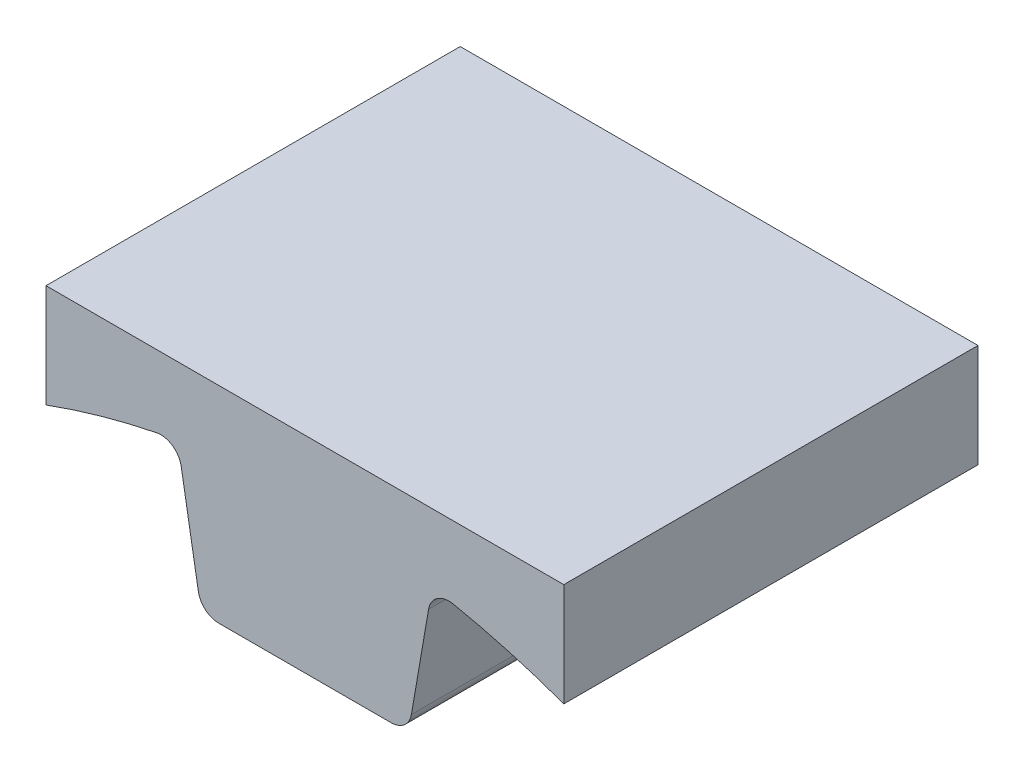
ISO-10303-21;
HEADER;
FILE_DESCRIPTION(('STEP AP214'),'2;1');
FILE_NAME('part.step','',(''),(''),'','','');
FILE_SCHEMA(('AUTOMOTIVE_DESIGN { 1 0 10303 214 1 1 1 1 }'));
ENDSEC;
DATA;
#1=APPLICATION_CONTEXT('core data for automotive mechanical design processes');
#2=APPLICATION_PROTOCOL_DEFINITION('international standard','automotive_design',2000,#1);
#3=PRODUCT_CONTEXT('',#1,'mechanical');
#4=PRODUCT('Part','Part','',(#3));
#5=PRODUCT_RELATED_PRODUCT_CATEGORY('part','',(#4));
#6=PRODUCT_DEFINITION_FORMATION('','',#4);
#7=PRODUCT_DEFINITION_CONTEXT('part definition',#1,'design');
#8=PRODUCT_DEFINITION('design','',#6,#7);
#9=PRODUCT_DEFINITION_SHAPE('','',#8);
#10=(LENGTH_UNIT() NAMED_UNIT(*) SI_UNIT(.MILLI.,.METRE.));
#11=(NAMED_UNIT(*) PLANE_ANGLE_UNIT() SI_UNIT($,.RADIAN.));
#12=(NAMED_UNIT(*) SI_UNIT($,.STERADIAN.) SOLID_ANGLE_UNIT());
#13=UNCERTAINTY_MEASURE_WITH_UNIT(LENGTH_MEASURE(1.E-05),#10,'distance_accuracy_value','');
#14=(GEOMETRIC_REPRESENTATION_CONTEXT(3) GLOBAL_UNCERTAINTY_ASSIGNED_CONTEXT((#13)) GLOBAL_UNIT_ASSIGNED_CONTEXT((#10,
#11,#12)) REPRESENTATION_CONTEXT('',''));
#15=CARTESIAN_POINT('',(0.,0.,0.));
#16=DIRECTION('',(0.,0.,1.));
#17=DIRECTION('',(1.,0.,0.));
#18=AXIS2_PLACEMENT_3D('',#15,#16,#17);
#19=CARTESIAN_POINT('',(12.7,73.8463201567954,50.8));
#20=DIRECTION('',(-0.985531811148546,0.169490557891188,0.));
#21=DIRECTION('',(-0.169490557891188,-0.985531811148546,0.));
#22=AXIS2_PLACEMENT_3D('',#19,#20,#21);
#23=PLANE('',#22);
#24=DIRECTION('',(0.169490557891188,0.985531811148546,0.));
#25=VECTOR('',#24,1.);
#26=CARTESIAN_POINT('',(12.7,73.8463201567954,50.8));
#27=LINE('',#26,#25);
#28=CARTESIAN_POINT('',(13.0627882002334,75.9558141397518,50.8));
#29=VERTEX_POINT('',#28);
#30=CARTESIAN_POINT('',(15.1692294033622,88.2040764608313,50.8));
#31=VERTEX_POINT('',#30);
#32=EDGE_CURVE('E137',#29,#31,#27,.T.);
#33=ORIENTED_EDGE('',*,*,#32,.F.);
#34=DIRECTION('',(0.,0.,-1.));
#35=VECTOR('',#34,1.);
#36=CARTESIAN_POINT('',(13.0627882002334,75.9558141397518,50.8));
#37=LINE('',#36,#35);
#38=CARTESIAN_POINT('',(13.0627882002334,75.9558141397518,0.));
#39=VERTEX_POINT('',#38);
#40=EDGE_CURVE('E240',#29,#39,#37,.T.);
#41=ORIENTED_EDGE('',*,*,#40,.T.);
#42=DIRECTION('',(0.169490557891188,0.985531811148546,0.));
#43=VECTOR('',#42,1.);
#44=CARTESIAN_POINT('',(12.7,73.8463201567954,0.));
#45=LINE('',#44,#43);
#46=CARTESIAN_POINT('',(15.1692294033622,88.2040764608313,0.));
#47=VERTEX_POINT('',#46);
#48=EDGE_CURVE('E175',#39,#47,#45,.T.);
#49=ORIENTED_EDGE('',*,*,#48,.T.);
#50=DIRECTION('',(0.,0.,1.));
#51=VECTOR('',#50,1.);
#52=CARTESIAN_POINT('',(15.1692294033622,88.2040764608313,50.8));
#53=LINE('',#52,#51);
#54=EDGE_CURVE('E61',#47,#31,#53,.T.);
#55=ORIENTED_EDGE('',*,*,#54,.T.);
#56=EDGE_LOOP('',(#33,#41,#49,#55));
#57=FACE_BOUND('',#56,.T.);
#58=ADVANCED_FACE('F39',(#57),#23,.F.);
#59=CARTESIAN_POINT('',(0.,0.,50.8));
#60=DIRECTION('',(0.,0.,-1.));
#61=DIRECTION('',(-1.,0.,0.));
#62=AXIS2_PLACEMENT_3D('',#59,#60,#61);
#63=CYLINDRICAL_SURFACE('',#62,92.075);
#64=CARTESIAN_POINT('',(0.,0.,50.8));
#65=DIRECTION('',(0.,0.,-1.));
#66=DIRECTION('',(1.,0.,0.));
#67=AXIS2_PLACEMENT_3D('',#64,#65,#66);
#68=CIRCLE('',#67,92.075);
#69=CARTESIAN_POINT('',(18.1738271598122,90.2636008109873,50.8));
#70=VERTEX_POINT('',#69);
#71=CARTESIAN_POINT('',(31.75,86.4276756889829,50.8));
#72=VERTEX_POINT('',#71);
#73=EDGE_CURVE('E126',#70,#72,#68,.T.);
#74=ORIENTED_EDGE('',*,*,#73,.F.);
#75=DIRECTION('',(0.,0.,-1.));
#76=VECTOR('',#75,1.);
#77=CARTESIAN_POINT('',(18.1738271598122,90.2636008109873,50.8));
#78=LINE('',#77,#76);
#79=CARTESIAN_POINT('',(18.1738271598122,90.2636008109873,0.));
#80=VERTEX_POINT('',#79);
#81=EDGE_CURVE('E244',#70,#80,#78,.T.);
#82=ORIENTED_EDGE('',*,*,#81,.T.);
#83=CARTESIAN_POINT('',(0.,0.,0.));
#84=DIRECTION('',(0.,0.,-1.));
#85=DIRECTION('',(1.,0.,0.));
#86=AXIS2_PLACEMENT_3D('',#83,#84,#85);
#87=CIRCLE('',#86,92.075);
#88=CARTESIAN_POINT('',(31.75,86.4276756889829,0.));
#89=VERTEX_POINT('',#88);
#90=EDGE_CURVE('E143',#80,#89,#87,.T.);
#91=ORIENTED_EDGE('',*,*,#90,.T.);
#92=DIRECTION('',(0.,0.,-1.));
#93=VECTOR('',#92,1.);
#94=CARTESIAN_POINT('',(31.75,86.4276756889829,50.8));
#95=LINE('',#94,#93);
#96=EDGE_CURVE('E140',#72,#89,#95,.T.);
#97=ORIENTED_EDGE('',*,*,#96,.F.);
#98=EDGE_LOOP('',(#74,#82,#91,#97));
#99=FACE_BOUND('',#98,.T.);
#100=ADVANCED_FACE('F141',(#99),#63,.F.);
#101=CARTESIAN_POINT('',(31.75,99.1022756889829,50.8));
#102=DIRECTION('',(-1.,0.,0.));
#103=DIRECTION('',(0.,-1.,0.));
#104=AXIS2_PLACEMENT_3D('',#101,#102,#103);
#105=PLANE('',#104);
#106=DIRECTION('',(0.,1.,0.));
#107=VECTOR('',#106,1.);
#108=CARTESIAN_POINT('',(31.75,99.1022756889829,0.));
#109=LINE('',#108,#107);
#110=CARTESIAN_POINT('',(31.75,99.1022756889829,0.));
#111=VERTEX_POINT('',#110);
#112=EDGE_CURVE('E180',#89,#111,#109,.T.);
#113=ORIENTED_EDGE('',*,*,#112,.T.);
#114=DIRECTION('',(0.,0.,-1.));
#115=VECTOR('',#114,1.);
#116=CARTESIAN_POINT('',(31.75,99.1022756889829,50.8));
#117=LINE('',#116,#115);
#118=CARTESIAN_POINT('',(31.75,99.1022756889829,50.8));
#119=VERTEX_POINT('',#118);
#120=EDGE_CURVE('E148',#119,#111,#117,.T.);
#121=ORIENTED_EDGE('',*,*,#120,.F.);
#122=DIRECTION('',(0.,1.,0.));
#123=VECTOR('',#122,1.);
#124=CARTESIAN_POINT('',(31.75,99.1022756889829,50.8));
#125=LINE('',#124,#123);
#126=EDGE_CURVE('E131',#72,#119,#125,.T.);
#127=ORIENTED_EDGE('',*,*,#126,.F.);
#128=ORIENTED_EDGE('',*,*,#96,.T.);
#129=EDGE_LOOP('',(#113,#121,#127,#128));
#130=FACE_BOUND('',#129,.T.);
#131=ADVANCED_FACE('F150',(#130),#105,.F.);
#132=CARTESIAN_POINT('',(-31.75,99.1022756889829,50.8));
#133=DIRECTION('',(0.,-1.,0.));
#134=DIRECTION('',(0.,0.,-1.));
#135=AXIS2_PLACEMENT_3D('',#132,#133,#134);
#136=PLANE('',#135);
#137=DIRECTION('',(-1.,0.,0.));
#138=VECTOR('',#137,1.);
#139=CARTESIAN_POINT('',(-31.75,99.1022756889829,0.));
#140=LINE('',#139,#138);
#141=CARTESIAN_POINT('',(-31.75,99.1022756889829,0.));
#142=VERTEX_POINT('',#141);
#143=EDGE_CURVE('E183',#111,#142,#140,.T.);
#144=ORIENTED_EDGE('',*,*,#143,.T.);
#145=DIRECTION('',(0.,0.,-1.));
#146=VECTOR('',#145,1.);
#147=CARTESIAN_POINT('',(-31.75,99.1022756889829,50.8));
#148=LINE('',#147,#146);
#149=CARTESIAN_POINT('',(-31.75,99.1022756889829,50.8));
#150=VERTEX_POINT('',#149);
#151=EDGE_CURVE('E204',#150,#142,#148,.T.);
#152=ORIENTED_EDGE('',*,*,#151,.F.);
#153=DIRECTION('',(-1.,0.,0.));
#154=VECTOR('',#153,1.);
#155=CARTESIAN_POINT('',(-31.75,99.1022756889829,50.8));
#156=LINE('',#155,#154);
#157=EDGE_CURVE('E154',#119,#150,#156,.T.);
#158=ORIENTED_EDGE('',*,*,#157,.F.);
#159=ORIENTED_EDGE('',*,*,#120,.T.);
#160=EDGE_LOOP('',(#144,#152,#158,#159));
#161=FACE_BOUND('',#160,.T.);
#162=ADVANCED_FACE('F310',(#161),#136,.F.);
#163=CARTESIAN_POINT('',(-31.75,99.1022756889829,50.8));
#164=DIRECTION('',(1.,0.,0.));
#165=DIRECTION('',(0.,1.,0.));
#166=AXIS2_PLACEMENT_3D('',#163,#164,#165);
#167=PLANE('',#166);
#168=DIRECTION('',(0.,-1.,0.));
#169=VECTOR('',#168,1.);
#170=CARTESIAN_POINT('',(-31.75,99.1022756889829,0.));
#171=LINE('',#170,#169);
#172=CARTESIAN_POINT('',(-31.75,86.4276756889829,0.));
#173=VERTEX_POINT('',#172);
#174=EDGE_CURVE('E186',#142,#173,#171,.T.);
#175=ORIENTED_EDGE('',*,*,#174,.T.);
#176=DIRECTION('',(0.,0.,-1.));
#177=VECTOR('',#176,1.);
#178=CARTESIAN_POINT('',(-31.75,86.4276756889829,50.8));
#179=LINE('',#178,#177);
#180=CARTESIAN_POINT('',(-31.75,86.4276756889829,50.8));
#181=VERTEX_POINT('',#180);
#182=EDGE_CURVE('E174',#181,#173,#179,.T.);
#183=ORIENTED_EDGE('',*,*,#182,.F.);
#184=DIRECTION('',(0.,-1.,0.));
#185=VECTOR('',#184,1.);
#186=CARTESIAN_POINT('',(-31.75,99.1022756889829,50.8));
#187=LINE('',#186,#185);
#188=EDGE_CURVE('E157',#150,#181,#187,.T.);
#189=ORIENTED_EDGE('',*,*,#188,.F.);
#190=ORIENTED_EDGE('',*,*,#151,.T.);
#191=EDGE_LOOP('',(#175,#183,#189,#190));
#192=FACE_BOUND('',#191,.T.);
#193=ADVANCED_FACE('F306',(#192),#167,.F.);
#194=CARTESIAN_POINT('',(0.,0.,50.8));
#195=DIRECTION('',(0.,0.,-1.));
#196=DIRECTION('',(-1.,0.,0.));
#197=AXIS2_PLACEMENT_3D('',#194,#195,#196);
#198=CYLINDRICAL_SURFACE('',#197,92.075);
#199=CARTESIAN_POINT('',(0.,0.,0.));
#200=DIRECTION('',(0.,0.,-1.));
#201=DIRECTION('',(-1.,0.,0.));
#202=AXIS2_PLACEMENT_3D('',#199,#200,#201);
#203=CIRCLE('',#202,92.075);
#204=CARTESIAN_POINT('',(-18.1738271598122,90.2636008109873,0.));
#205=VERTEX_POINT('',#204);
#206=EDGE_CURVE('E189',#173,#205,#203,.T.);
#207=ORIENTED_EDGE('',*,*,#206,.T.);
#208=DIRECTION('',(0.,0.,-1.));
#209=VECTOR('',#208,1.);
#210=CARTESIAN_POINT('',(-18.1738271598122,90.2636008109873,50.8));
#211=LINE('',#210,#209);
#212=CARTESIAN_POINT('',(-18.1738271598122,90.2636008109873,50.8));
#213=VERTEX_POINT('',#212);
#214=EDGE_CURVE('E216',#205,#213,#211,.F.);
#215=ORIENTED_EDGE('',*,*,#214,.T.);
#216=CARTESIAN_POINT('',(0.,0.,50.8));
#217=DIRECTION('',(0.,0.,-1.));
#218=DIRECTION('',(-1.,0.,0.));
#219=AXIS2_PLACEMENT_3D('',#216,#217,#218);
#220=CIRCLE('',#219,92.075);
#221=EDGE_CURVE('E163',#181,#213,#220,.T.);
#222=ORIENTED_EDGE('',*,*,#221,.F.);
#223=ORIENTED_EDGE('',*,*,#182,.T.);
#224=EDGE_LOOP('',(#207,#215,#222,#223));
#225=FACE_BOUND('',#224,.T.);
#226=ADVANCED_FACE('F301',(#225),#198,.F.);
#227=CARTESIAN_POINT('',(-12.7,73.8463201567954,50.8));
#228=DIRECTION('',(0.985531811148546,0.169490557891188,0.));
#229=DIRECTION('',(-0.169490557891188,0.985531811148546,0.));
#230=AXIS2_PLACEMENT_3D('',#227,#228,#229);
#231=PLANE('',#230);
#232=DIRECTION('',(0.169490557891188,-0.985531811148546,0.));
#233=VECTOR('',#232,1.);
#234=CARTESIAN_POINT('',(-12.7,73.8463201567954,50.8));
#235=LINE('',#234,#233);
#236=CARTESIAN_POINT('',(-15.1692294033622,88.2040764608313,50.8));
#237=VERTEX_POINT('',#236);
#238=CARTESIAN_POINT('',(-13.0627882002334,75.9558141397518,50.8));
#239=VERTEX_POINT('',#238);
#240=EDGE_CURVE('E167',#237,#239,#235,.T.);
#241=ORIENTED_EDGE('',*,*,#240,.F.);
#242=DIRECTION('',(0.,0.,1.));
#243=VECTOR('',#242,1.);
#244=CARTESIAN_POINT('',(-15.1692294033622,88.2040764608313,0.));
#245=LINE('',#244,#243);
#246=CARTESIAN_POINT('',(-15.1692294033622,88.2040764608313,0.));
#247=VERTEX_POINT('',#246);
#248=EDGE_CURVE('E212',#237,#247,#245,.F.);
#249=ORIENTED_EDGE('',*,*,#248,.T.);
#250=DIRECTION('',(0.169490557891188,-0.985531811148546,0.));
#251=VECTOR('',#250,1.);
#252=CARTESIAN_POINT('',(-12.7,73.8463201567954,0.));
#253=LINE('',#252,#251);
#254=CARTESIAN_POINT('',(-13.0627882002334,75.9558141397518,0.));
#255=VERTEX_POINT('',#254);
#256=EDGE_CURVE('E193',#247,#255,#253,.T.);
#257=ORIENTED_EDGE('',*,*,#256,.T.);
#258=DIRECTION('',(0.,0.,-1.));
#259=VECTOR('',#258,1.);
#260=CARTESIAN_POINT('',(-13.0627882002334,75.9558141397518,50.8));
#261=LINE('',#260,#259);
#262=EDGE_CURVE('E147',#255,#239,#261,.F.);
#263=ORIENTED_EDGE('',*,*,#262,.T.);
#264=EDGE_LOOP('',(#241,#249,#257,#263));
#265=FACE_BOUND('',#264,.T.);
#266=ADVANCED_FACE('F294',(#265),#231,.F.);
#267=CARTESIAN_POINT('',(-12.7,73.8463201567954,50.8));
#268=DIRECTION('',(0.,1.,0.));
#269=DIRECTION('',(0.,0.,1.));
#270=AXIS2_PLACEMENT_3D('',#267,#268,#269);
#271=PLANE('',#270);
#272=DIRECTION('',(1.,0.,0.));
#273=VECTOR('',#272,1.);
#274=CARTESIAN_POINT('',(-12.7,73.8463201567954,50.8));
#275=LINE('',#274,#273);
#276=CARTESIAN_POINT('',(-10.5595373999161,73.8463201567954,50.8));
#277=VERTEX_POINT('',#276);
#278=CARTESIAN_POINT('',(10.5595373999161,73.8463201567954,50.8));
#279=VERTEX_POINT('',#278);
#280=EDGE_CURVE('E170',#277,#279,#275,.T.);
#281=ORIENTED_EDGE('',*,*,#280,.F.);
#282=DIRECTION('',(0.,0.,-1.));
#283=VECTOR('',#282,1.);
#284=CARTESIAN_POINT('',(-10.5595373999161,73.8463201567954,50.8));
#285=LINE('',#284,#283);
#286=CARTESIAN_POINT('',(-10.5595373999161,73.8463201567954,0.));
#287=VERTEX_POINT('',#286);
#288=EDGE_CURVE('E222',#277,#287,#285,.T.);
#289=ORIENTED_EDGE('',*,*,#288,.T.);
#290=DIRECTION('',(1.,0.,0.));
#291=VECTOR('',#290,1.);
#292=CARTESIAN_POINT('',(-12.7,73.8463201567954,0.));
#293=LINE('',#292,#291);
#294=CARTESIAN_POINT('',(10.5595373999161,73.8463201567954,0.));
#295=VERTEX_POINT('',#294);
#296=EDGE_CURVE('E197',#287,#295,#293,.T.);
#297=ORIENTED_EDGE('',*,*,#296,.T.);
#298=DIRECTION('',(0.,0.,-1.));
#299=VECTOR('',#298,1.);
#300=CARTESIAN_POINT('',(10.5595373999161,73.8463201567954,50.8));
#301=LINE('',#300,#299);
#302=EDGE_CURVE('E219',#295,#279,#301,.F.);
#303=ORIENTED_EDGE('',*,*,#302,.T.);
#304=EDGE_LOOP('',(#281,#289,#297,#303));
#305=FACE_BOUND('',#304,.T.);
#306=ADVANCED_FACE('F289',(#305),#271,.F.);
#307=CARTESIAN_POINT('',(0.,0.,50.8));
#308=DIRECTION('',(0.,0.,1.));
#309=DIRECTION('',(1.,0.,0.));
#310=AXIS2_PLACEMENT_3D('',#307,#308,#309);
#311=PLANE('',#310);
#312=ORIENTED_EDGE('',*,*,#240,.T.);
#313=CARTESIAN_POINT('',(-10.5595373999161,76.3863201567954,50.8));
#314=DIRECTION('',(0.,0.,1.));
#315=DIRECTION('',(1.,0.,0.));
#316=AXIS2_PLACEMENT_3D('',#313,#314,#315);
#317=CIRCLE('',#316,2.54);
#318=EDGE_CURVE('E235',#239,#277,#317,.T.);
#319=ORIENTED_EDGE('',*,*,#318,.T.);
#320=ORIENTED_EDGE('',*,*,#280,.T.);
#321=CARTESIAN_POINT('',(10.5595373999161,76.3863201567954,50.8));
#322=DIRECTION('',(0.,0.,1.));
#323=DIRECTION('',(1.,0.,0.));
#324=AXIS2_PLACEMENT_3D('',#321,#322,#323);
#325=CIRCLE('',#324,2.54);
#326=EDGE_CURVE('E232',#279,#29,#325,.T.);
#327=ORIENTED_EDGE('',*,*,#326,.T.);
#328=ORIENTED_EDGE('',*,*,#32,.T.);
#329=CARTESIAN_POINT('',(17.6724802036795,87.7735704437876,50.8));
#330=DIRECTION('',(0.,0.,1.));
#331=DIRECTION('',(1.,0.,0.));
#332=AXIS2_PLACEMENT_3D('',#329,#330,#331);
#333=CIRCLE('',#332,2.54);
#334=EDGE_CURVE('E11',#31,#70,#333,.F.);
#335=ORIENTED_EDGE('',*,*,#334,.T.);
#336=ORIENTED_EDGE('',*,*,#73,.T.);
#337=ORIENTED_EDGE('',*,*,#126,.T.);
#338=ORIENTED_EDGE('',*,*,#157,.T.);
#339=ORIENTED_EDGE('',*,*,#188,.T.);
#340=ORIENTED_EDGE('',*,*,#221,.T.);
#341=CARTESIAN_POINT('',(-17.6724802036795,87.7735704437876,50.8));
#342=DIRECTION('',(0.,0.,1.));
#343=DIRECTION('',(1.,0.,0.));
#344=AXIS2_PLACEMENT_3D('',#341,#342,#343);
#345=CIRCLE('',#344,2.54);
#346=EDGE_CURVE('E250',#213,#237,#345,.F.);
#347=ORIENTED_EDGE('',*,*,#346,.T.);
#348=EDGE_LOOP('',(#312,#319,#320,#327,#328,#335,#336,#337,#338,#339,#340,#347));
#349=FACE_BOUND('',#348,.T.);
#350=ADVANCED_FACE('F129',(#349),#311,.T.);
#351=CARTESIAN_POINT('',(0.,0.,0.));
#352=DIRECTION('',(0.,0.,1.));
#353=DIRECTION('',(1.,0.,0.));
#354=AXIS2_PLACEMENT_3D('',#351,#352,#353);
#355=PLANE('',#354);
#356=ORIENTED_EDGE('',*,*,#296,.F.);
#357=CARTESIAN_POINT('',(-10.5595373999161,76.3863201567954,0.));
#358=DIRECTION('',(0.,0.,1.));
#359=DIRECTION('',(1.,0.,0.));
#360=AXIS2_PLACEMENT_3D('',#357,#358,#359);
#361=CIRCLE('',#360,2.54);
#362=EDGE_CURVE('E229',#287,#255,#361,.F.);
#363=ORIENTED_EDGE('',*,*,#362,.T.);
#364=ORIENTED_EDGE('',*,*,#256,.F.);
#365=CARTESIAN_POINT('',(-17.6724802036795,87.7735704437876,0.));
#366=DIRECTION('',(0.,0.,1.));
#367=DIRECTION('',(1.,0.,0.));
#368=AXIS2_PLACEMENT_3D('',#365,#366,#367);
#369=CIRCLE('',#368,2.54);
#370=EDGE_CURVE('E247',#247,#205,#369,.T.);
#371=ORIENTED_EDGE('',*,*,#370,.T.);
#372=ORIENTED_EDGE('',*,*,#206,.F.);
#373=ORIENTED_EDGE('',*,*,#174,.F.);
#374=ORIENTED_EDGE('',*,*,#143,.F.);
#375=ORIENTED_EDGE('',*,*,#112,.F.);
#376=ORIENTED_EDGE('',*,*,#90,.F.);
#377=CARTESIAN_POINT('',(17.6724802036795,87.7735704437876,0.));
#378=DIRECTION('',(0.,0.,1.));
#379=DIRECTION('',(1.,0.,0.));
#380=AXIS2_PLACEMENT_3D('',#377,#378,#379);
#381=CIRCLE('',#380,2.54);
#382=EDGE_CURVE('E48',#80,#47,#381,.T.);
#383=ORIENTED_EDGE('',*,*,#382,.T.);
#384=ORIENTED_EDGE('',*,*,#48,.F.);
#385=CARTESIAN_POINT('',(10.5595373999161,76.3863201567954,0.));
#386=DIRECTION('',(0.,0.,1.));
#387=DIRECTION('',(1.,0.,0.));
#388=AXIS2_PLACEMENT_3D('',#385,#386,#387);
#389=CIRCLE('',#388,2.54);
#390=EDGE_CURVE('E226',#39,#295,#389,.F.);
#391=ORIENTED_EDGE('',*,*,#390,.T.);
#392=EDGE_LOOP('',(#356,#363,#364,#371,#372,#373,#374,#375,#376,#383,#384,#391));
#393=FACE_BOUND('',#392,.T.);
#394=ADVANCED_FACE('F256',(#393),#355,.F.);
#395=CARTESIAN_POINT('',(-17.6724802036795,87.7735704437876,50.8));
#396=DIRECTION('',(0.,0.,-1.));
#397=DIRECTION('',(-1.,0.,0.));
#398=AXIS2_PLACEMENT_3D('',#395,#396,#397);
#399=CYLINDRICAL_SURFACE('',#398,2.54);
#400=ORIENTED_EDGE('',*,*,#346,.F.);
#401=ORIENTED_EDGE('',*,*,#214,.F.);
#402=ORIENTED_EDGE('',*,*,#370,.F.);
#403=ORIENTED_EDGE('',*,*,#248,.F.);
#404=EDGE_LOOP('',(#400,#401,#402,#403));
#405=FACE_BOUND('',#404,.T.);
#406=ADVANCED_FACE('F274',(#405),#399,.F.);
#407=CARTESIAN_POINT('',(-10.5595373999161,76.3863201567954,50.8));
#408=DIRECTION('',(0.,0.,-1.));
#409=DIRECTION('',(-1.,0.,0.));
#410=AXIS2_PLACEMENT_3D('',#407,#408,#409);
#411=CYLINDRICAL_SURFACE('',#410,2.54);
#412=ORIENTED_EDGE('',*,*,#318,.F.);
#413=ORIENTED_EDGE('',*,*,#262,.F.);
#414=ORIENTED_EDGE('',*,*,#362,.F.);
#415=ORIENTED_EDGE('',*,*,#288,.F.);
#416=EDGE_LOOP('',(#412,#413,#414,#415));
#417=FACE_BOUND('',#416,.T.);
#418=ADVANCED_FACE('F264',(#417),#411,.T.);
#419=CARTESIAN_POINT('',(10.5595373999161,76.3863201567954,50.8));
#420=DIRECTION('',(0.,0.,-1.));
#421=DIRECTION('',(-1.,0.,0.));
#422=AXIS2_PLACEMENT_3D('',#419,#420,#421);
#423=CYLINDRICAL_SURFACE('',#422,2.54);
#424=ORIENTED_EDGE('',*,*,#326,.F.);
#425=ORIENTED_EDGE('',*,*,#302,.F.);
#426=ORIENTED_EDGE('',*,*,#390,.F.);
#427=ORIENTED_EDGE('',*,*,#40,.F.);
#428=EDGE_LOOP('',(#424,#425,#426,#427));
#429=FACE_BOUND('',#428,.T.);
#430=ADVANCED_FACE('F260',(#429),#423,.T.);
#431=CARTESIAN_POINT('',(17.6724802036795,87.7735704437876,50.8));
#432=DIRECTION('',(0.,0.,-1.));
#433=DIRECTION('',(-1.,0.,0.));
#434=AXIS2_PLACEMENT_3D('',#431,#432,#433);
#435=CYLINDRICAL_SURFACE('',#434,2.54);
#436=ORIENTED_EDGE('',*,*,#334,.F.);
#437=ORIENTED_EDGE('',*,*,#54,.F.);
#438=ORIENTED_EDGE('',*,*,#382,.F.);
#439=ORIENTED_EDGE('',*,*,#81,.F.);
#440=EDGE_LOOP('',(#436,#437,#438,#439));
#441=FACE_BOUND('',#440,.T.);
#442=ADVANCED_FACE('F41',(#441),#435,.F.);
#443=CLOSED_SHELL('',(#58,#100,#131,#162,#193,#226,#266,#306,#350,#394,#406,#418,#430,#442));
#444=MANIFOLD_SOLID_BREP('B2',#443);
#445=ADVANCED_BREP_SHAPE_REPRESENTATION('',(#18,#444),#14);
#446=SHAPE_DEFINITION_REPRESENTATION(#9,#445);
ENDSEC;
END-ISO-10303-21;
